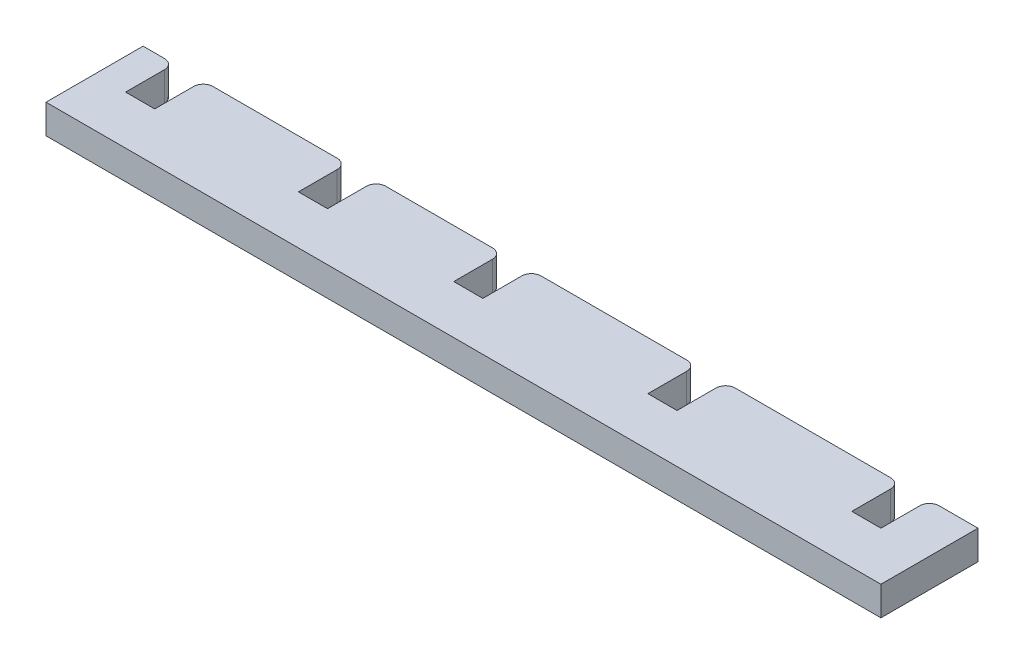
ISO-10303-21;
HEADER;
FILE_DESCRIPTION(('STEP AP214'),'2;1');
FILE_NAME('part.step','',(''),(''),'','','');
FILE_SCHEMA(('AUTOMOTIVE_DESIGN { 1 0 10303 214 1 1 1 1 }'));
ENDSEC;
DATA;
#1=APPLICATION_CONTEXT('core data for automotive mechanical design processes');
#2=APPLICATION_PROTOCOL_DEFINITION('international standard','automotive_design',2000,#1);
#3=PRODUCT_CONTEXT('',#1,'mechanical');
#4=PRODUCT('Part','Part','',(#3));
#5=PRODUCT_RELATED_PRODUCT_CATEGORY('part','',(#4));
#6=PRODUCT_DEFINITION_FORMATION('','',#4);
#7=PRODUCT_DEFINITION_CONTEXT('part definition',#1,'design');
#8=PRODUCT_DEFINITION('design','',#6,#7);
#9=PRODUCT_DEFINITION_SHAPE('','',#8);
#10=(LENGTH_UNIT() NAMED_UNIT(*) SI_UNIT(.MILLI.,.METRE.));
#11=(NAMED_UNIT(*) PLANE_ANGLE_UNIT() SI_UNIT($,.RADIAN.));
#12=(NAMED_UNIT(*) SI_UNIT($,.STERADIAN.) SOLID_ANGLE_UNIT());
#13=UNCERTAINTY_MEASURE_WITH_UNIT(LENGTH_MEASURE(1.E-05),#10,'distance_accuracy_value','');
#14=(GEOMETRIC_REPRESENTATION_CONTEXT(3) GLOBAL_UNCERTAINTY_ASSIGNED_CONTEXT((#13)) GLOBAL_UNIT_ASSIGNED_CONTEXT((#10,
#11,#12)) REPRESENTATION_CONTEXT('',''));
#15=CARTESIAN_POINT('',(0.,0.,0.));
#16=DIRECTION('',(0.,0.,1.));
#17=DIRECTION('',(1.,0.,0.));
#18=AXIS2_PLACEMENT_3D('',#15,#16,#17);
#19=CARTESIAN_POINT('',(0.,0.,0.));
#20=DIRECTION('',(0.,0.,-1.));
#21=DIRECTION('',(-1.,0.,0.));
#22=AXIS2_PLACEMENT_3D('',#19,#20,#21);
#23=PLANE('',#22);
#24=DIRECTION('',(1.,0.,0.));
#25=VECTOR('',#24,1.);
#26=CARTESIAN_POINT('',(0.,0.,0.));
#27=LINE('',#26,#25);
#28=CARTESIAN_POINT('',(82.,0.,0.));
#29=VERTEX_POINT('',#28);
#30=CARTESIAN_POINT('',(86.,0.,0.));
#31=VERTEX_POINT('',#30);
#32=EDGE_CURVE('E389',#29,#31,#27,.T.);
#33=ORIENTED_EDGE('',*,*,#32,.F.);
#34=DIRECTION('',(0.,-1.,0.));
#35=VECTOR('',#34,1.);
#36=CARTESIAN_POINT('',(82.,3.,0.));
#37=LINE('',#36,#35);
#38=CARTESIAN_POINT('',(82.,3.,0.));
#39=VERTEX_POINT('',#38);
#40=EDGE_CURVE('E11',#29,#39,#37,.F.);
#41=ORIENTED_EDGE('',*,*,#40,.T.);
#42=DIRECTION('',(-1.,0.,0.));
#43=VECTOR('',#42,1.);
#44=CARTESIAN_POINT('',(0.,3.,0.));
#45=LINE('',#44,#43);
#46=CARTESIAN_POINT('',(86.,3.,0.));
#47=VERTEX_POINT('',#46);
#48=EDGE_CURVE('E379',#47,#39,#45,.T.);
#49=ORIENTED_EDGE('',*,*,#48,.F.);
#50=DIRECTION('',(0.,1.,0.));
#51=VECTOR('',#50,1.);
#52=CARTESIAN_POINT('',(86.,0.,0.));
#53=LINE('',#52,#51);
#54=EDGE_CURVE('E393',#31,#47,#53,.T.);
#55=ORIENTED_EDGE('',*,*,#54,.F.);
#56=EDGE_LOOP('',(#33,#41,#49,#55));
#57=FACE_BOUND('',#56,.T.);
#58=ADVANCED_FACE('F33',(#57),#23,.T.);
#59=CARTESIAN_POINT('',(61.,0.,0.));
#60=VERTEX_POINT('',#59);
#61=CARTESIAN_POINT('',(77.,0.,0.));
#62=VERTEX_POINT('',#61);
#63=EDGE_CURVE('E395',#60,#62,#27,.T.);
#64=ORIENTED_EDGE('',*,*,#63,.F.);
#65=DIRECTION('',(0.,-1.,0.));
#66=VECTOR('',#65,1.);
#67=CARTESIAN_POINT('',(61.,3.,0.));
#68=LINE('',#67,#66);
#69=CARTESIAN_POINT('',(61.,3.,0.));
#70=VERTEX_POINT('',#69);
#71=EDGE_CURVE('E490',#60,#70,#68,.F.);
#72=ORIENTED_EDGE('',*,*,#71,.T.);
#73=CARTESIAN_POINT('',(77.,3.,0.));
#74=VERTEX_POINT('',#73);
#75=EDGE_CURVE('E400',#74,#70,#45,.T.);
#76=ORIENTED_EDGE('',*,*,#75,.F.);
#77=DIRECTION('',(0.,1.,0.));
#78=VECTOR('',#77,1.);
#79=CARTESIAN_POINT('',(77.,0.,0.));
#80=LINE('',#79,#78);
#81=EDGE_CURVE('E56',#74,#62,#80,.F.);
#82=ORIENTED_EDGE('',*,*,#81,.T.);
#83=EDGE_LOOP('',(#64,#72,#76,#82));
#84=FACE_BOUND('',#83,.T.);
#85=ADVANCED_FACE('F544',(#84),#23,.T.);
#86=CARTESIAN_POINT('',(41.,0.,0.));
#87=VERTEX_POINT('',#86);
#88=CARTESIAN_POINT('',(56.,0.,0.));
#89=VERTEX_POINT('',#88);
#90=EDGE_CURVE('E511',#87,#89,#27,.T.);
#91=ORIENTED_EDGE('',*,*,#90,.F.);
#92=DIRECTION('',(0.,-1.,0.));
#93=VECTOR('',#92,1.);
#94=CARTESIAN_POINT('',(41.,3.,0.));
#95=LINE('',#94,#93);
#96=CARTESIAN_POINT('',(41.,3.,0.));
#97=VERTEX_POINT('',#96);
#98=EDGE_CURVE('E481',#87,#97,#95,.F.);
#99=ORIENTED_EDGE('',*,*,#98,.T.);
#100=CARTESIAN_POINT('',(56.,3.,0.));
#101=VERTEX_POINT('',#100);
#102=EDGE_CURVE('E548',#101,#97,#45,.T.);
#103=ORIENTED_EDGE('',*,*,#102,.F.);
#104=DIRECTION('',(0.,1.,0.));
#105=VECTOR('',#104,1.);
#106=CARTESIAN_POINT('',(56.,0.,0.));
#107=LINE('',#106,#105);
#108=EDGE_CURVE('E479',#101,#89,#107,.F.);
#109=ORIENTED_EDGE('',*,*,#108,.T.);
#110=EDGE_LOOP('',(#91,#99,#103,#109));
#111=FACE_BOUND('',#110,.T.);
#112=ADVANCED_FACE('F589',(#111),#23,.T.);
#113=CARTESIAN_POINT('',(25.,0.,0.));
#114=VERTEX_POINT('',#113);
#115=CARTESIAN_POINT('',(36.,0.,0.));
#116=VERTEX_POINT('',#115);
#117=EDGE_CURVE('E513',#114,#116,#27,.T.);
#118=ORIENTED_EDGE('',*,*,#117,.F.);
#119=DIRECTION('',(0.,-1.,0.));
#120=VECTOR('',#119,1.);
#121=CARTESIAN_POINT('',(25.,3.,0.));
#122=LINE('',#121,#120);
#123=CARTESIAN_POINT('',(25.,3.,0.));
#124=VERTEX_POINT('',#123);
#125=EDGE_CURVE('E471',#114,#124,#122,.F.);
#126=ORIENTED_EDGE('',*,*,#125,.T.);
#127=CARTESIAN_POINT('',(36.,3.,0.));
#128=VERTEX_POINT('',#127);
#129=EDGE_CURVE('E549',#128,#124,#45,.T.);
#130=ORIENTED_EDGE('',*,*,#129,.F.);
#131=DIRECTION('',(0.,1.,0.));
#132=VECTOR('',#131,1.);
#133=CARTESIAN_POINT('',(36.,0.,0.));
#134=LINE('',#133,#132);
#135=EDGE_CURVE('E469',#128,#116,#134,.F.);
#136=ORIENTED_EDGE('',*,*,#135,.T.);
#137=EDGE_LOOP('',(#118,#126,#130,#136));
#138=FACE_BOUND('',#137,.T.);
#139=ADVANCED_FACE('F602',(#138),#23,.T.);
#140=CARTESIAN_POINT('',(7.19999999999998,0.,0.));
#141=VERTEX_POINT('',#140);
#142=CARTESIAN_POINT('',(20.,0.,0.));
#143=VERTEX_POINT('',#142);
#144=EDGE_CURVE('E394',#141,#143,#27,.T.);
#145=ORIENTED_EDGE('',*,*,#144,.F.);
#146=DIRECTION('',(0.,-1.,0.));
#147=VECTOR('',#146,1.);
#148=CARTESIAN_POINT('',(7.19999999999998,3.,0.));
#149=LINE('',#148,#147);
#150=CARTESIAN_POINT('',(7.19999999999998,3.,0.));
#151=VERTEX_POINT('',#150);
#152=EDGE_CURVE('E461',#141,#151,#149,.F.);
#153=ORIENTED_EDGE('',*,*,#152,.T.);
#154=CARTESIAN_POINT('',(20.,3.,0.));
#155=VERTEX_POINT('',#154);
#156=EDGE_CURVE('E552',#155,#151,#45,.T.);
#157=ORIENTED_EDGE('',*,*,#156,.F.);
#158=DIRECTION('',(0.,1.,0.));
#159=VECTOR('',#158,1.);
#160=CARTESIAN_POINT('',(20.,0.,0.));
#161=LINE('',#160,#159);
#162=EDGE_CURVE('E459',#155,#143,#161,.F.);
#163=ORIENTED_EDGE('',*,*,#162,.T.);
#164=EDGE_LOOP('',(#145,#153,#157,#163));
#165=FACE_BOUND('',#164,.T.);
#166=ADVANCED_FACE('F593',(#165),#23,.T.);
#167=CARTESIAN_POINT('',(0.,0.,10.));
#168=DIRECTION('',(1.,0.,0.));
#169=DIRECTION('',(0.,0.,-1.));
#170=AXIS2_PLACEMENT_3D('',#167,#168,#169);
#171=PLANE('',#170);
#172=DIRECTION('',(0.,-1.,0.));
#173=VECTOR('',#172,1.);
#174=CARTESIAN_POINT('',(0.,0.,0.));
#175=LINE('',#174,#173);
#176=CARTESIAN_POINT('',(0.,3.,0.));
#177=VERTEX_POINT('',#176);
#178=CARTESIAN_POINT('',(0.,0.,0.));
#179=VERTEX_POINT('',#178);
#180=EDGE_CURVE('E386',#177,#179,#175,.T.);
#181=ORIENTED_EDGE('',*,*,#180,.T.);
#182=DIRECTION('',(0.,0.,-1.));
#183=VECTOR('',#182,1.);
#184=CARTESIAN_POINT('',(0.,0.,10.));
#185=LINE('',#184,#183);
#186=CARTESIAN_POINT('',(0.,0.,10.));
#187=VERTEX_POINT('',#186);
#188=EDGE_CURVE('E409',#187,#179,#185,.T.);
#189=ORIENTED_EDGE('',*,*,#188,.F.);
#190=DIRECTION('',(0.,-1.,0.));
#191=VECTOR('',#190,1.);
#192=CARTESIAN_POINT('',(0.,0.,10.));
#193=LINE('',#192,#191);
#194=CARTESIAN_POINT('',(0.,3.,10.));
#195=VERTEX_POINT('',#194);
#196=EDGE_CURVE('E375',#195,#187,#193,.T.);
#197=ORIENTED_EDGE('',*,*,#196,.F.);
#198=DIRECTION('',(0.,0.,-1.));
#199=VECTOR('',#198,1.);
#200=CARTESIAN_POINT('',(0.,3.,10.));
#201=LINE('',#200,#199);
#202=EDGE_CURVE('E385',#195,#177,#201,.T.);
#203=ORIENTED_EDGE('',*,*,#202,.T.);
#204=EDGE_LOOP('',(#181,#189,#197,#203));
#205=FACE_BOUND('',#204,.T.);
#206=ADVANCED_FACE('F566',(#205),#171,.F.);
#207=CARTESIAN_POINT('',(0.,0.,10.));
#208=DIRECTION('',(0.,1.,0.));
#209=DIRECTION('',(0.,0.,1.));
#210=AXIS2_PLACEMENT_3D('',#207,#208,#209);
#211=PLANE('',#210);
#212=CARTESIAN_POINT('',(2.19999999999998,0.,0.));
#213=VERTEX_POINT('',#212);
#214=EDGE_CURVE('E391',#179,#213,#27,.T.);
#215=ORIENTED_EDGE('',*,*,#214,.T.);
#216=CARTESIAN_POINT('',(2.19999999999998,0.,1.));
#217=DIRECTION('',(0.,1.,0.));
#218=DIRECTION('',(0.,0.,1.));
#219=AXIS2_PLACEMENT_3D('',#216,#217,#218);
#220=CIRCLE('',#219,1.);
#221=CARTESIAN_POINT('',(3.19999999999998,0.,1.));
#222=VERTEX_POINT('',#221);
#223=EDGE_CURVE('E454',#213,#222,#220,.F.);
#224=ORIENTED_EDGE('',*,*,#223,.T.);
#225=DIRECTION('',(0.,0.,-1.));
#226=VECTOR('',#225,1.);
#227=CARTESIAN_POINT('',(3.19999999999998,0.,5.));
#228=LINE('',#227,#226);
#229=CARTESIAN_POINT('',(3.19999999999998,0.,5.));
#230=VERTEX_POINT('',#229);
#231=EDGE_CURVE('E364',#230,#222,#228,.T.);
#232=ORIENTED_EDGE('',*,*,#231,.F.);
#233=DIRECTION('',(-1.,0.,0.));
#234=VECTOR('',#233,1.);
#235=CARTESIAN_POINT('',(3.19999999999998,0.,5.));
#236=LINE('',#235,#234);
#237=CARTESIAN_POINT('',(6.19999999999998,0.,5.));
#238=VERTEX_POINT('',#237);
#239=EDGE_CURVE('E353',#238,#230,#236,.T.);
#240=ORIENTED_EDGE('',*,*,#239,.F.);
#241=DIRECTION('',(0.,0.,-1.));
#242=VECTOR('',#241,1.);
#243=CARTESIAN_POINT('',(6.19999999999998,0.,5.));
#244=LINE('',#243,#242);
#245=CARTESIAN_POINT('',(6.19999999999998,0.,1.));
#246=VERTEX_POINT('',#245);
#247=EDGE_CURVE('E334',#238,#246,#244,.T.);
#248=ORIENTED_EDGE('',*,*,#247,.T.);
#249=CARTESIAN_POINT('',(7.19999999999998,0.,1.));
#250=DIRECTION('',(0.,1.,0.));
#251=DIRECTION('',(0.,0.,1.));
#252=AXIS2_PLACEMENT_3D('',#249,#250,#251);
#253=CIRCLE('',#252,1.);
#254=EDGE_CURVE('E452',#246,#141,#253,.F.);
#255=ORIENTED_EDGE('',*,*,#254,.T.);
#256=ORIENTED_EDGE('',*,*,#144,.T.);
#257=CARTESIAN_POINT('',(20.,0.,1.));
#258=DIRECTION('',(0.,1.,0.));
#259=DIRECTION('',(0.,0.,1.));
#260=AXIS2_PLACEMENT_3D('',#257,#258,#259);
#261=CIRCLE('',#260,1.);
#262=CARTESIAN_POINT('',(21.,0.,1.));
#263=VERTEX_POINT('',#262);
#264=EDGE_CURVE('E450',#143,#263,#261,.F.);
#265=ORIENTED_EDGE('',*,*,#264,.T.);
#266=DIRECTION('',(0.,0.,-1.));
#267=VECTOR('',#266,1.);
#268=CARTESIAN_POINT('',(21.,0.,5.));
#269=LINE('',#268,#267);
#270=CARTESIAN_POINT('',(21.,0.,5.));
#271=VERTEX_POINT('',#270);
#272=EDGE_CURVE('E342',#271,#263,#269,.T.);
#273=ORIENTED_EDGE('',*,*,#272,.F.);
#274=DIRECTION('',(-1.,0.,0.));
#275=VECTOR('',#274,1.);
#276=CARTESIAN_POINT('',(21.,0.,5.));
#277=LINE('',#276,#275);
#278=CARTESIAN_POINT('',(24.,0.,5.));
#279=VERTEX_POINT('',#278);
#280=EDGE_CURVE('E330',#279,#271,#277,.T.);
#281=ORIENTED_EDGE('',*,*,#280,.F.);
#282=DIRECTION('',(0.,0.,-1.));
#283=VECTOR('',#282,1.);
#284=CARTESIAN_POINT('',(24.,0.,5.));
#285=LINE('',#284,#283);
#286=CARTESIAN_POINT('',(24.,0.,1.));
#287=VERTEX_POINT('',#286);
#288=EDGE_CURVE('E311',#279,#287,#285,.T.);
#289=ORIENTED_EDGE('',*,*,#288,.T.);
#290=CARTESIAN_POINT('',(25.,0.,1.));
#291=DIRECTION('',(0.,1.,0.));
#292=DIRECTION('',(0.,0.,1.));
#293=AXIS2_PLACEMENT_3D('',#290,#291,#292);
#294=CIRCLE('',#293,1.);
#295=EDGE_CURVE('E448',#287,#114,#294,.F.);
#296=ORIENTED_EDGE('',*,*,#295,.T.);
#297=ORIENTED_EDGE('',*,*,#117,.T.);
#298=CARTESIAN_POINT('',(36.,0.,1.));
#299=DIRECTION('',(0.,1.,0.));
#300=DIRECTION('',(0.,0.,1.));
#301=AXIS2_PLACEMENT_3D('',#298,#299,#300);
#302=CIRCLE('',#301,1.);
#303=CARTESIAN_POINT('',(37.,0.,1.));
#304=VERTEX_POINT('',#303);
#305=EDGE_CURVE('E446',#116,#304,#302,.F.);
#306=ORIENTED_EDGE('',*,*,#305,.T.);
#307=DIRECTION('',(0.,0.,-1.));
#308=VECTOR('',#307,1.);
#309=CARTESIAN_POINT('',(37.,0.,5.));
#310=LINE('',#309,#308);
#311=CARTESIAN_POINT('',(37.,0.,5.));
#312=VERTEX_POINT('',#311);
#313=EDGE_CURVE('E319',#312,#304,#310,.T.);
#314=ORIENTED_EDGE('',*,*,#313,.F.);
#315=DIRECTION('',(-1.,0.,0.));
#316=VECTOR('',#315,1.);
#317=CARTESIAN_POINT('',(37.,0.,5.));
#318=LINE('',#317,#316);
#319=CARTESIAN_POINT('',(40.,0.,5.));
#320=VERTEX_POINT('',#319);
#321=EDGE_CURVE('E307',#320,#312,#318,.T.);
#322=ORIENTED_EDGE('',*,*,#321,.F.);
#323=DIRECTION('',(0.,0.,-1.));
#324=VECTOR('',#323,1.);
#325=CARTESIAN_POINT('',(40.,0.,5.));
#326=LINE('',#325,#324);
#327=CARTESIAN_POINT('',(40.,0.,1.));
#328=VERTEX_POINT('',#327);
#329=EDGE_CURVE('E288',#320,#328,#326,.T.);
#330=ORIENTED_EDGE('',*,*,#329,.T.);
#331=CARTESIAN_POINT('',(41.,0.,1.));
#332=DIRECTION('',(0.,1.,0.));
#333=DIRECTION('',(0.,0.,1.));
#334=AXIS2_PLACEMENT_3D('',#331,#332,#333);
#335=CIRCLE('',#334,1.);
#336=EDGE_CURVE('E444',#328,#87,#335,.F.);
#337=ORIENTED_EDGE('',*,*,#336,.T.);
#338=ORIENTED_EDGE('',*,*,#90,.T.);
#339=CARTESIAN_POINT('',(56.,0.,1.));
#340=DIRECTION('',(0.,1.,0.));
#341=DIRECTION('',(0.,0.,1.));
#342=AXIS2_PLACEMENT_3D('',#339,#340,#341);
#343=CIRCLE('',#342,1.);
#344=CARTESIAN_POINT('',(57.,0.,1.));
#345=VERTEX_POINT('',#344);
#346=EDGE_CURVE('E442',#89,#345,#343,.F.);
#347=ORIENTED_EDGE('',*,*,#346,.T.);
#348=DIRECTION('',(0.,0.,-1.));
#349=VECTOR('',#348,1.);
#350=CARTESIAN_POINT('',(57.,0.,5.));
#351=LINE('',#350,#349);
#352=CARTESIAN_POINT('',(57.,0.,5.));
#353=VERTEX_POINT('',#352);
#354=EDGE_CURVE('E296',#353,#345,#351,.T.);
#355=ORIENTED_EDGE('',*,*,#354,.F.);
#356=DIRECTION('',(-1.,0.,0.));
#357=VECTOR('',#356,1.);
#358=CARTESIAN_POINT('',(57.,0.,5.));
#359=LINE('',#358,#357);
#360=CARTESIAN_POINT('',(60.,0.,5.));
#361=VERTEX_POINT('',#360);
#362=EDGE_CURVE('E284',#361,#353,#359,.T.);
#363=ORIENTED_EDGE('',*,*,#362,.F.);
#364=DIRECTION('',(0.,0.,-1.));
#365=VECTOR('',#364,1.);
#366=CARTESIAN_POINT('',(60.,0.,5.));
#367=LINE('',#366,#365);
#368=CARTESIAN_POINT('',(60.,0.,1.));
#369=VERTEX_POINT('',#368);
#370=EDGE_CURVE('E274',#361,#369,#367,.T.);
#371=ORIENTED_EDGE('',*,*,#370,.T.);
#372=CARTESIAN_POINT('',(61.,0.,1.));
#373=DIRECTION('',(0.,1.,0.));
#374=DIRECTION('',(0.,0.,1.));
#375=AXIS2_PLACEMENT_3D('',#372,#373,#374);
#376=CIRCLE('',#375,1.);
#377=EDGE_CURVE('E440',#369,#60,#376,.F.);
#378=ORIENTED_EDGE('',*,*,#377,.T.);
#379=ORIENTED_EDGE('',*,*,#63,.T.);
#380=CARTESIAN_POINT('',(77.,0.,1.));
#381=DIRECTION('',(0.,1.,0.));
#382=DIRECTION('',(0.,0.,1.));
#383=AXIS2_PLACEMENT_3D('',#380,#381,#382);
#384=CIRCLE('',#383,1.);
#385=CARTESIAN_POINT('',(78.,0.,1.));
#386=VERTEX_POINT('',#385);
#387=EDGE_CURVE('E48',#62,#386,#384,.F.);
#388=ORIENTED_EDGE('',*,*,#387,.T.);
#389=DIRECTION('',(0.,0.,-1.));
#390=VECTOR('',#389,1.);
#391=CARTESIAN_POINT('',(78.,0.,5.));
#392=LINE('',#391,#390);
#393=CARTESIAN_POINT('',(78.,0.,5.));
#394=VERTEX_POINT('',#393);
#395=EDGE_CURVE('E259',#394,#386,#392,.T.);
#396=ORIENTED_EDGE('',*,*,#395,.F.);
#397=DIRECTION('',(-1.,0.,0.));
#398=VECTOR('',#397,1.);
#399=CARTESIAN_POINT('',(78.,0.,5.));
#400=LINE('',#399,#398);
#401=CARTESIAN_POINT('',(81.,0.,5.));
#402=VERTEX_POINT('',#401);
#403=EDGE_CURVE('E266',#402,#394,#400,.T.);
#404=ORIENTED_EDGE('',*,*,#403,.F.);
#405=DIRECTION('',(0.,0.,-1.));
#406=VECTOR('',#405,1.);
#407=CARTESIAN_POINT('',(81.,0.,5.));
#408=LINE('',#407,#406);
#409=CARTESIAN_POINT('',(81.,0.,1.));
#410=VERTEX_POINT('',#409);
#411=EDGE_CURVE('E390',#402,#410,#408,.T.);
#412=ORIENTED_EDGE('',*,*,#411,.T.);
#413=CARTESIAN_POINT('',(82.,0.,1.));
#414=DIRECTION('',(0.,1.,0.));
#415=DIRECTION('',(0.,0.,1.));
#416=AXIS2_PLACEMENT_3D('',#413,#414,#415);
#417=CIRCLE('',#416,1.);
#418=EDGE_CURVE('E437',#410,#29,#417,.F.);
#419=ORIENTED_EDGE('',*,*,#418,.T.);
#420=ORIENTED_EDGE('',*,*,#32,.T.);
#421=DIRECTION('',(0.,0.,-1.));
#422=VECTOR('',#421,1.);
#423=CARTESIAN_POINT('',(86.,0.,10.));
#424=LINE('',#423,#422);
#425=CARTESIAN_POINT('',(86.,0.,10.));
#426=VERTEX_POINT('',#425);
#427=EDGE_CURVE('E406',#426,#31,#424,.T.);
#428=ORIENTED_EDGE('',*,*,#427,.F.);
#429=DIRECTION('',(1.,0.,0.));
#430=VECTOR('',#429,1.);
#431=CARTESIAN_POINT('',(0.,0.,10.));
#432=LINE('',#431,#430);
#433=EDGE_CURVE('E378',#187,#426,#432,.T.);
#434=ORIENTED_EDGE('',*,*,#433,.F.);
#435=ORIENTED_EDGE('',*,*,#188,.T.);
#436=EDGE_LOOP('',(#215,#224,#232,#240,#248,#255,#256,#265,#273,#281,#289,#296,#297,#306,#314,
#322,#330,#337,#338,#347,#355,#363,#371,#378,#379,#388,#396,#404,#412,#419,#420,#428,#434,#435));
#437=FACE_BOUND('',#436,.T.);
#438=ADVANCED_FACE('F277',(#437),#211,.F.);
#439=CARTESIAN_POINT('',(86.,0.,10.));
#440=DIRECTION('',(-1.,0.,0.));
#441=DIRECTION('',(0.,0.,1.));
#442=AXIS2_PLACEMENT_3D('',#439,#440,#441);
#443=PLANE('',#442);
#444=ORIENTED_EDGE('',*,*,#54,.T.);
#445=DIRECTION('',(0.,0.,-1.));
#446=VECTOR('',#445,1.);
#447=CARTESIAN_POINT('',(86.,3.,10.));
#448=LINE('',#447,#446);
#449=CARTESIAN_POINT('',(86.,3.,10.));
#450=VERTEX_POINT('',#449);
#451=EDGE_CURVE('E403',#450,#47,#448,.T.);
#452=ORIENTED_EDGE('',*,*,#451,.F.);
#453=DIRECTION('',(0.,1.,0.));
#454=VECTOR('',#453,1.);
#455=CARTESIAN_POINT('',(86.,0.,10.));
#456=LINE('',#455,#454);
#457=EDGE_CURVE('E381',#426,#450,#456,.T.);
#458=ORIENTED_EDGE('',*,*,#457,.F.);
#459=ORIENTED_EDGE('',*,*,#427,.T.);
#460=EDGE_LOOP('',(#444,#452,#458,#459));
#461=FACE_BOUND('',#460,.T.);
#462=ADVANCED_FACE('F575',(#461),#443,.F.);
#463=CARTESIAN_POINT('',(0.,3.,10.));
#464=DIRECTION('',(0.,-1.,0.));
#465=DIRECTION('',(0.,0.,-1.));
#466=AXIS2_PLACEMENT_3D('',#463,#464,#465);
#467=PLANE('',#466);
#468=DIRECTION('',(0.,0.,-1.));
#469=VECTOR('',#468,1.);
#470=CARTESIAN_POINT('',(3.19999999999998,3.,5.));
#471=LINE('',#470,#469);
#472=CARTESIAN_POINT('',(3.19999999999998,3.,5.));
#473=VERTEX_POINT('',#472);
#474=CARTESIAN_POINT('',(3.19999999999998,3.,1.));
#475=VERTEX_POINT('',#474);
#476=EDGE_CURVE('E370',#473,#475,#471,.T.);
#477=ORIENTED_EDGE('',*,*,#476,.T.);
#478=CARTESIAN_POINT('',(2.19999999999998,3.,1.));
#479=DIRECTION('',(0.,-1.,0.));
#480=DIRECTION('',(0.,0.,-1.));
#481=AXIS2_PLACEMENT_3D('',#478,#479,#480);
#482=CIRCLE('',#481,1.);
#483=CARTESIAN_POINT('',(2.19999999999998,3.,0.));
#484=VERTEX_POINT('',#483);
#485=EDGE_CURVE('E433',#475,#484,#482,.F.);
#486=ORIENTED_EDGE('',*,*,#485,.T.);
#487=EDGE_CURVE('E397',#484,#177,#45,.T.);
#488=ORIENTED_EDGE('',*,*,#487,.T.);
#489=ORIENTED_EDGE('',*,*,#202,.F.);
#490=DIRECTION('',(-1.,0.,0.));
#491=VECTOR('',#490,1.);
#492=CARTESIAN_POINT('',(0.,3.,10.));
#493=LINE('',#492,#491);
#494=EDGE_CURVE('E383',#450,#195,#493,.T.);
#495=ORIENTED_EDGE('',*,*,#494,.F.);
#496=ORIENTED_EDGE('',*,*,#451,.T.);
#497=ORIENTED_EDGE('',*,*,#48,.T.);
#498=CARTESIAN_POINT('',(82.,3.,1.));
#499=DIRECTION('',(0.,-1.,0.));
#500=DIRECTION('',(0.,0.,-1.));
#501=AXIS2_PLACEMENT_3D('',#498,#499,#500);
#502=CIRCLE('',#501,1.);
#503=CARTESIAN_POINT('',(81.,3.,1.));
#504=VERTEX_POINT('',#503);
#505=EDGE_CURVE('E415',#39,#504,#502,.F.);
#506=ORIENTED_EDGE('',*,*,#505,.T.);
#507=DIRECTION('',(0.,0.,-1.));
#508=VECTOR('',#507,1.);
#509=CARTESIAN_POINT('',(81.,3.,5.));
#510=LINE('',#509,#508);
#511=CARTESIAN_POINT('',(81.,3.,5.));
#512=VERTEX_POINT('',#511);
#513=EDGE_CURVE('E279',#512,#504,#510,.T.);
#514=ORIENTED_EDGE('',*,*,#513,.F.);
#515=DIRECTION('',(1.,0.,0.));
#516=VECTOR('',#515,1.);
#517=CARTESIAN_POINT('',(81.,3.,5.));
#518=LINE('',#517,#516);
#519=CARTESIAN_POINT('',(78.,3.,5.));
#520=VERTEX_POINT('',#519);
#521=EDGE_CURVE('E265',#520,#512,#518,.T.);
#522=ORIENTED_EDGE('',*,*,#521,.F.);
#523=DIRECTION('',(0.,0.,-1.));
#524=VECTOR('',#523,1.);
#525=CARTESIAN_POINT('',(78.,3.,5.));
#526=LINE('',#525,#524);
#527=CARTESIAN_POINT('',(78.,3.,1.));
#528=VERTEX_POINT('',#527);
#529=EDGE_CURVE('E262',#520,#528,#526,.T.);
#530=ORIENTED_EDGE('',*,*,#529,.T.);
#531=CARTESIAN_POINT('',(77.,3.,1.));
#532=DIRECTION('',(0.,-1.,0.));
#533=DIRECTION('',(0.,0.,-1.));
#534=AXIS2_PLACEMENT_3D('',#531,#532,#533);
#535=CIRCLE('',#534,1.);
#536=EDGE_CURVE('E417',#528,#74,#535,.F.);
#537=ORIENTED_EDGE('',*,*,#536,.T.);
#538=ORIENTED_EDGE('',*,*,#75,.T.);
#539=CARTESIAN_POINT('',(61.,3.,1.));
#540=DIRECTION('',(0.,-1.,0.));
#541=DIRECTION('',(0.,0.,-1.));
#542=AXIS2_PLACEMENT_3D('',#539,#540,#541);
#543=CIRCLE('',#542,1.);
#544=CARTESIAN_POINT('',(60.,3.,1.));
#545=VERTEX_POINT('',#544);
#546=EDGE_CURVE('E419',#70,#545,#543,.F.);
#547=ORIENTED_EDGE('',*,*,#546,.T.);
#548=DIRECTION('',(0.,0.,-1.));
#549=VECTOR('',#548,1.);
#550=CARTESIAN_POINT('',(60.,3.,5.));
#551=LINE('',#550,#549);
#552=CARTESIAN_POINT('',(60.,3.,5.));
#553=VERTEX_POINT('',#552);
#554=EDGE_CURVE('E299',#553,#545,#551,.T.);
#555=ORIENTED_EDGE('',*,*,#554,.F.);
#556=DIRECTION('',(1.,0.,0.));
#557=VECTOR('',#556,1.);
#558=CARTESIAN_POINT('',(60.,3.,5.));
#559=LINE('',#558,#557);
#560=CARTESIAN_POINT('',(57.,3.,5.));
#561=VERTEX_POINT('',#560);
#562=EDGE_CURVE('E291',#561,#553,#559,.T.);
#563=ORIENTED_EDGE('',*,*,#562,.F.);
#564=DIRECTION('',(0.,0.,-1.));
#565=VECTOR('',#564,1.);
#566=CARTESIAN_POINT('',(57.,3.,5.));
#567=LINE('',#566,#565);
#568=CARTESIAN_POINT('',(57.,3.,1.));
#569=VERTEX_POINT('',#568);
#570=EDGE_CURVE('E302',#561,#569,#567,.T.);
#571=ORIENTED_EDGE('',*,*,#570,.T.);
#572=CARTESIAN_POINT('',(56.,3.,1.));
#573=DIRECTION('',(0.,-1.,0.));
#574=DIRECTION('',(0.,0.,-1.));
#575=AXIS2_PLACEMENT_3D('',#572,#573,#574);
#576=CIRCLE('',#575,1.);
#577=EDGE_CURVE('E421',#569,#101,#576,.F.);
#578=ORIENTED_EDGE('',*,*,#577,.T.);
#579=ORIENTED_EDGE('',*,*,#102,.T.);
#580=CARTESIAN_POINT('',(41.,3.,1.));
#581=DIRECTION('',(0.,-1.,0.));
#582=DIRECTION('',(0.,0.,-1.));
#583=AXIS2_PLACEMENT_3D('',#580,#581,#582);
#584=CIRCLE('',#583,1.);
#585=CARTESIAN_POINT('',(40.,3.,1.));
#586=VERTEX_POINT('',#585);
#587=EDGE_CURVE('E423',#97,#586,#584,.F.);
#588=ORIENTED_EDGE('',*,*,#587,.T.);
#589=DIRECTION('',(0.,0.,-1.));
#590=VECTOR('',#589,1.);
#591=CARTESIAN_POINT('',(40.,3.,5.));
#592=LINE('',#591,#590);
#593=CARTESIAN_POINT('',(40.,3.,5.));
#594=VERTEX_POINT('',#593);
#595=EDGE_CURVE('E322',#594,#586,#592,.T.);
#596=ORIENTED_EDGE('',*,*,#595,.F.);
#597=DIRECTION('',(1.,0.,0.));
#598=VECTOR('',#597,1.);
#599=CARTESIAN_POINT('',(40.,3.,5.));
#600=LINE('',#599,#598);
#601=CARTESIAN_POINT('',(37.,3.,5.));
#602=VERTEX_POINT('',#601);
#603=EDGE_CURVE('E314',#602,#594,#600,.T.);
#604=ORIENTED_EDGE('',*,*,#603,.F.);
#605=DIRECTION('',(0.,0.,-1.));
#606=VECTOR('',#605,1.);
#607=CARTESIAN_POINT('',(37.,3.,5.));
#608=LINE('',#607,#606);
#609=CARTESIAN_POINT('',(37.,3.,1.));
#610=VERTEX_POINT('',#609);
#611=EDGE_CURVE('E325',#602,#610,#608,.T.);
#612=ORIENTED_EDGE('',*,*,#611,.T.);
#613=CARTESIAN_POINT('',(36.,3.,1.));
#614=DIRECTION('',(0.,-1.,0.));
#615=DIRECTION('',(0.,0.,-1.));
#616=AXIS2_PLACEMENT_3D('',#613,#614,#615);
#617=CIRCLE('',#616,1.);
#618=EDGE_CURVE('E425',#610,#128,#617,.F.);
#619=ORIENTED_EDGE('',*,*,#618,.T.);
#620=ORIENTED_EDGE('',*,*,#129,.T.);
#621=CARTESIAN_POINT('',(25.,3.,1.));
#622=DIRECTION('',(0.,-1.,0.));
#623=DIRECTION('',(0.,0.,-1.));
#624=AXIS2_PLACEMENT_3D('',#621,#622,#623);
#625=CIRCLE('',#624,1.);
#626=CARTESIAN_POINT('',(24.,3.,1.));
#627=VERTEX_POINT('',#626);
#628=EDGE_CURVE('E427',#124,#627,#625,.F.);
#629=ORIENTED_EDGE('',*,*,#628,.T.);
#630=DIRECTION('',(0.,0.,-1.));
#631=VECTOR('',#630,1.);
#632=CARTESIAN_POINT('',(24.,3.,5.));
#633=LINE('',#632,#631);
#634=CARTESIAN_POINT('',(24.,3.,5.));
#635=VERTEX_POINT('',#634);
#636=EDGE_CURVE('E345',#635,#627,#633,.T.);
#637=ORIENTED_EDGE('',*,*,#636,.F.);
#638=DIRECTION('',(1.,0.,0.));
#639=VECTOR('',#638,1.);
#640=CARTESIAN_POINT('',(24.,3.,5.));
#641=LINE('',#640,#639);
#642=CARTESIAN_POINT('',(21.,3.,5.));
#643=VERTEX_POINT('',#642);
#644=EDGE_CURVE('E337',#643,#635,#641,.T.);
#645=ORIENTED_EDGE('',*,*,#644,.F.);
#646=DIRECTION('',(0.,0.,-1.));
#647=VECTOR('',#646,1.);
#648=CARTESIAN_POINT('',(21.,3.,5.));
#649=LINE('',#648,#647);
#650=CARTESIAN_POINT('',(21.,3.,1.));
#651=VERTEX_POINT('',#650);
#652=EDGE_CURVE('E348',#643,#651,#649,.T.);
#653=ORIENTED_EDGE('',*,*,#652,.T.);
#654=CARTESIAN_POINT('',(20.,3.,1.));
#655=DIRECTION('',(0.,-1.,0.));
#656=DIRECTION('',(0.,0.,-1.));
#657=AXIS2_PLACEMENT_3D('',#654,#655,#656);
#658=CIRCLE('',#657,1.);
#659=EDGE_CURVE('E429',#651,#155,#658,.F.);
#660=ORIENTED_EDGE('',*,*,#659,.T.);
#661=ORIENTED_EDGE('',*,*,#156,.T.);
#662=CARTESIAN_POINT('',(7.19999999999998,3.,1.));
#663=DIRECTION('',(0.,-1.,0.));
#664=DIRECTION('',(0.,0.,-1.));
#665=AXIS2_PLACEMENT_3D('',#662,#663,#664);
#666=CIRCLE('',#665,1.);
#667=CARTESIAN_POINT('',(6.19999999999998,3.,1.));
#668=VERTEX_POINT('',#667);
#669=EDGE_CURVE('E431',#151,#668,#666,.F.);
#670=ORIENTED_EDGE('',*,*,#669,.T.);
#671=DIRECTION('',(0.,0.,-1.));
#672=VECTOR('',#671,1.);
#673=CARTESIAN_POINT('',(6.19999999999998,3.,5.));
#674=LINE('',#673,#672);
#675=CARTESIAN_POINT('',(6.19999999999998,3.,5.));
#676=VERTEX_POINT('',#675);
#677=EDGE_CURVE('E367',#676,#668,#674,.T.);
#678=ORIENTED_EDGE('',*,*,#677,.F.);
#679=DIRECTION('',(1.,0.,0.));
#680=VECTOR('',#679,1.);
#681=CARTESIAN_POINT('',(6.19999999999998,3.,5.));
#682=LINE('',#681,#680);
#683=EDGE_CURVE('E359',#473,#676,#682,.T.);
#684=ORIENTED_EDGE('',*,*,#683,.F.);
#685=EDGE_LOOP('',(#477,#486,#488,#489,#495,#496,#497,#506,#514,#522,#530,#537,#538,#547,#555,
#563,#571,#578,#579,#588,#596,#604,#612,#619,#620,#629,#637,#645,#653,#660,#661,#670,#678,#684));
#686=FACE_BOUND('',#685,.T.);
#687=ADVANCED_FACE('F505',(#686),#467,.F.);
#688=CARTESIAN_POINT('',(0.,0.,10.));
#689=DIRECTION('',(0.,0.,-1.));
#690=DIRECTION('',(-1.,0.,0.));
#691=AXIS2_PLACEMENT_3D('',#688,#689,#690);
#692=PLANE('',#691);
#693=ORIENTED_EDGE('',*,*,#196,.T.);
#694=ORIENTED_EDGE('',*,*,#433,.T.);
#695=ORIENTED_EDGE('',*,*,#457,.T.);
#696=ORIENTED_EDGE('',*,*,#494,.T.);
#697=EDGE_LOOP('',(#693,#694,#695,#696));
#698=FACE_BOUND('',#697,.T.);
#699=ADVANCED_FACE('F572',(#698),#692,.F.);
#700=ORIENTED_EDGE('',*,*,#487,.F.);
#701=DIRECTION('',(0.,1.,0.));
#702=VECTOR('',#701,1.);
#703=CARTESIAN_POINT('',(2.19999999999998,0.,0.));
#704=LINE('',#703,#702);
#705=EDGE_CURVE('E435',#484,#213,#704,.F.);
#706=ORIENTED_EDGE('',*,*,#705,.T.);
#707=ORIENTED_EDGE('',*,*,#214,.F.);
#708=ORIENTED_EDGE('',*,*,#180,.F.);
#709=EDGE_LOOP('',(#700,#706,#707,#708));
#710=FACE_BOUND('',#709,.T.);
#711=ADVANCED_FACE('F568',(#710),#23,.T.);
#712=CARTESIAN_POINT('',(6.19999999999998,3.,5.));
#713=DIRECTION('',(1.,0.,0.));
#714=DIRECTION('',(0.,0.,-1.));
#715=AXIS2_PLACEMENT_3D('',#712,#713,#714);
#716=PLANE('',#715);
#717=ORIENTED_EDGE('',*,*,#677,.T.);
#718=DIRECTION('',(0.,-1.,0.));
#719=VECTOR('',#718,1.);
#720=CARTESIAN_POINT('',(6.19999999999998,0.,1.));
#721=LINE('',#720,#719);
#722=EDGE_CURVE('E456',#668,#246,#721,.T.);
#723=ORIENTED_EDGE('',*,*,#722,.T.);
#724=ORIENTED_EDGE('',*,*,#247,.F.);
#725=DIRECTION('',(0.,-1.,0.));
#726=VECTOR('',#725,1.);
#727=CARTESIAN_POINT('',(6.19999999999998,3.,5.));
#728=LINE('',#727,#726);
#729=EDGE_CURVE('E361',#676,#238,#728,.T.);
#730=ORIENTED_EDGE('',*,*,#729,.F.);
#731=EDGE_LOOP('',(#717,#723,#724,#730));
#732=FACE_BOUND('',#731,.T.);
#733=ADVANCED_FACE('F592',(#732),#716,.F.);
#734=CARTESIAN_POINT('',(3.19999999999998,3.,5.));
#735=DIRECTION('',(-1.,0.,0.));
#736=DIRECTION('',(0.,-1.,0.));
#737=AXIS2_PLACEMENT_3D('',#734,#735,#736);
#738=PLANE('',#737);
#739=ORIENTED_EDGE('',*,*,#231,.T.);
#740=DIRECTION('',(0.,1.,0.));
#741=VECTOR('',#740,1.);
#742=CARTESIAN_POINT('',(3.19999999999998,3.,1.));
#743=LINE('',#742,#741);
#744=EDGE_CURVE('E412',#222,#475,#743,.T.);
#745=ORIENTED_EDGE('',*,*,#744,.T.);
#746=ORIENTED_EDGE('',*,*,#476,.F.);
#747=DIRECTION('',(0.,1.,0.));
#748=VECTOR('',#747,1.);
#749=CARTESIAN_POINT('',(3.19999999999998,3.,5.));
#750=LINE('',#749,#748);
#751=EDGE_CURVE('E356',#230,#473,#750,.T.);
#752=ORIENTED_EDGE('',*,*,#751,.F.);
#753=EDGE_LOOP('',(#739,#745,#746,#752));
#754=FACE_BOUND('',#753,.T.);
#755=ADVANCED_FACE('F598',(#754),#738,.F.);
#756=CARTESIAN_POINT('',(0.,0.,5.));
#757=DIRECTION('',(0.,0.,-1.));
#758=DIRECTION('',(-1.,0.,0.));
#759=AXIS2_PLACEMENT_3D('',#756,#757,#758);
#760=PLANE('',#759);
#761=ORIENTED_EDGE('',*,*,#239,.T.);
#762=ORIENTED_EDGE('',*,*,#751,.T.);
#763=ORIENTED_EDGE('',*,*,#683,.T.);
#764=ORIENTED_EDGE('',*,*,#729,.T.);
#765=EDGE_LOOP('',(#761,#762,#763,#764));
#766=FACE_BOUND('',#765,.T.);
#767=ADVANCED_FACE('F620',(#766),#760,.T.);
#768=CARTESIAN_POINT('',(24.,3.,5.));
#769=DIRECTION('',(1.,0.,0.));
#770=DIRECTION('',(0.,0.,-1.));
#771=AXIS2_PLACEMENT_3D('',#768,#769,#770);
#772=PLANE('',#771);
#773=ORIENTED_EDGE('',*,*,#636,.T.);
#774=DIRECTION('',(0.,-1.,0.));
#775=VECTOR('',#774,1.);
#776=CARTESIAN_POINT('',(24.,0.,1.));
#777=LINE('',#776,#775);
#778=EDGE_CURVE('E466',#627,#287,#777,.T.);
#779=ORIENTED_EDGE('',*,*,#778,.T.);
#780=ORIENTED_EDGE('',*,*,#288,.F.);
#781=DIRECTION('',(0.,-1.,0.));
#782=VECTOR('',#781,1.);
#783=CARTESIAN_POINT('',(24.,3.,5.));
#784=LINE('',#783,#782);
#785=EDGE_CURVE('E339',#635,#279,#784,.T.);
#786=ORIENTED_EDGE('',*,*,#785,.F.);
#787=EDGE_LOOP('',(#773,#779,#780,#786));
#788=FACE_BOUND('',#787,.T.);
#789=ADVANCED_FACE('F786',(#788),#772,.F.);
#790=CARTESIAN_POINT('',(21.,3.,5.));
#791=DIRECTION('',(-1.,0.,0.));
#792=DIRECTION('',(0.,-1.,0.));
#793=AXIS2_PLACEMENT_3D('',#790,#791,#792);
#794=PLANE('',#793);
#795=ORIENTED_EDGE('',*,*,#272,.T.);
#796=DIRECTION('',(0.,1.,0.));
#797=VECTOR('',#796,1.);
#798=CARTESIAN_POINT('',(21.,3.,1.));
#799=LINE('',#798,#797);
#800=EDGE_CURVE('E463',#263,#651,#799,.T.);
#801=ORIENTED_EDGE('',*,*,#800,.T.);
#802=ORIENTED_EDGE('',*,*,#652,.F.);
#803=DIRECTION('',(0.,1.,0.));
#804=VECTOR('',#803,1.);
#805=CARTESIAN_POINT('',(21.,3.,5.));
#806=LINE('',#805,#804);
#807=EDGE_CURVE('E333',#271,#643,#806,.T.);
#808=ORIENTED_EDGE('',*,*,#807,.F.);
#809=EDGE_LOOP('',(#795,#801,#802,#808));
#810=FACE_BOUND('',#809,.T.);
#811=ADVANCED_FACE('F781',(#810),#794,.F.);
#812=CARTESIAN_POINT('',(0.,0.,5.));
#813=DIRECTION('',(0.,0.,-1.));
#814=DIRECTION('',(-1.,0.,0.));
#815=AXIS2_PLACEMENT_3D('',#812,#813,#814);
#816=PLANE('',#815);
#817=ORIENTED_EDGE('',*,*,#280,.T.);
#818=ORIENTED_EDGE('',*,*,#807,.T.);
#819=ORIENTED_EDGE('',*,*,#644,.T.);
#820=ORIENTED_EDGE('',*,*,#785,.T.);
#821=EDGE_LOOP('',(#817,#818,#819,#820));
#822=FACE_BOUND('',#821,.T.);
#823=ADVANCED_FACE('F773',(#822),#816,.T.);
#824=CARTESIAN_POINT('',(40.,3.,5.));
#825=DIRECTION('',(1.,0.,0.));
#826=DIRECTION('',(0.,0.,-1.));
#827=AXIS2_PLACEMENT_3D('',#824,#825,#826);
#828=PLANE('',#827);
#829=ORIENTED_EDGE('',*,*,#595,.T.);
#830=DIRECTION('',(0.,-1.,0.));
#831=VECTOR('',#830,1.);
#832=CARTESIAN_POINT('',(40.,0.,1.));
#833=LINE('',#832,#831);
#834=EDGE_CURVE('E476',#586,#328,#833,.T.);
#835=ORIENTED_EDGE('',*,*,#834,.T.);
#836=ORIENTED_EDGE('',*,*,#329,.F.);
#837=DIRECTION('',(0.,-1.,0.));
#838=VECTOR('',#837,1.);
#839=CARTESIAN_POINT('',(40.,3.,5.));
#840=LINE('',#839,#838);
#841=EDGE_CURVE('E316',#594,#320,#840,.T.);
#842=ORIENTED_EDGE('',*,*,#841,.F.);
#843=EDGE_LOOP('',(#829,#835,#836,#842));
#844=FACE_BOUND('',#843,.T.);
#845=ADVANCED_FACE('F762',(#844),#828,.F.);
#846=CARTESIAN_POINT('',(37.,3.,5.));
#847=DIRECTION('',(-1.,0.,0.));
#848=DIRECTION('',(0.,0.,1.));
#849=AXIS2_PLACEMENT_3D('',#846,#847,#848);
#850=PLANE('',#849);
#851=ORIENTED_EDGE('',*,*,#313,.T.);
#852=DIRECTION('',(0.,1.,0.));
#853=VECTOR('',#852,1.);
#854=CARTESIAN_POINT('',(37.,3.,1.));
#855=LINE('',#854,#853);
#856=EDGE_CURVE('E473',#304,#610,#855,.T.);
#857=ORIENTED_EDGE('',*,*,#856,.T.);
#858=ORIENTED_EDGE('',*,*,#611,.F.);
#859=DIRECTION('',(0.,1.,0.));
#860=VECTOR('',#859,1.);
#861=CARTESIAN_POINT('',(37.,3.,5.));
#862=LINE('',#861,#860);
#863=EDGE_CURVE('E310',#312,#602,#862,.T.);
#864=ORIENTED_EDGE('',*,*,#863,.F.);
#865=EDGE_LOOP('',(#851,#857,#858,#864));
#866=FACE_BOUND('',#865,.T.);
#867=ADVANCED_FACE('F757',(#866),#850,.F.);
#868=CARTESIAN_POINT('',(0.,0.,5.));
#869=DIRECTION('',(0.,0.,-1.));
#870=DIRECTION('',(-1.,0.,0.));
#871=AXIS2_PLACEMENT_3D('',#868,#869,#870);
#872=PLANE('',#871);
#873=ORIENTED_EDGE('',*,*,#321,.T.);
#874=ORIENTED_EDGE('',*,*,#863,.T.);
#875=ORIENTED_EDGE('',*,*,#603,.T.);
#876=ORIENTED_EDGE('',*,*,#841,.T.);
#877=EDGE_LOOP('',(#873,#874,#875,#876));
#878=FACE_BOUND('',#877,.T.);
#879=ADVANCED_FACE('F750',(#878),#872,.T.);
#880=CARTESIAN_POINT('',(60.,3.,5.));
#881=DIRECTION('',(1.,0.,0.));
#882=DIRECTION('',(0.,0.,-1.));
#883=AXIS2_PLACEMENT_3D('',#880,#881,#882);
#884=PLANE('',#883);
#885=ORIENTED_EDGE('',*,*,#554,.T.);
#886=DIRECTION('',(0.,-1.,0.));
#887=VECTOR('',#886,1.);
#888=CARTESIAN_POINT('',(60.,0.,1.));
#889=LINE('',#888,#887);
#890=EDGE_CURVE('E486',#545,#369,#889,.T.);
#891=ORIENTED_EDGE('',*,*,#890,.T.);
#892=ORIENTED_EDGE('',*,*,#370,.F.);
#893=DIRECTION('',(0.,-1.,0.));
#894=VECTOR('',#893,1.);
#895=CARTESIAN_POINT('',(60.,3.,5.));
#896=LINE('',#895,#894);
#897=EDGE_CURVE('E293',#553,#361,#896,.T.);
#898=ORIENTED_EDGE('',*,*,#897,.F.);
#899=EDGE_LOOP('',(#885,#891,#892,#898));
#900=FACE_BOUND('',#899,.T.);
#901=ADVANCED_FACE('F540',(#900),#884,.F.);
#902=CARTESIAN_POINT('',(57.,3.,5.));
#903=DIRECTION('',(-1.,0.,0.));
#904=DIRECTION('',(0.,0.,1.));
#905=AXIS2_PLACEMENT_3D('',#902,#903,#904);
#906=PLANE('',#905);
#907=ORIENTED_EDGE('',*,*,#354,.T.);
#908=DIRECTION('',(0.,1.,0.));
#909=VECTOR('',#908,1.);
#910=CARTESIAN_POINT('',(57.,3.,1.));
#911=LINE('',#910,#909);
#912=EDGE_CURVE('E483',#345,#569,#911,.T.);
#913=ORIENTED_EDGE('',*,*,#912,.T.);
#914=ORIENTED_EDGE('',*,*,#570,.F.);
#915=DIRECTION('',(0.,1.,0.));
#916=VECTOR('',#915,1.);
#917=CARTESIAN_POINT('',(57.,3.,5.));
#918=LINE('',#917,#916);
#919=EDGE_CURVE('E287',#353,#561,#918,.T.);
#920=ORIENTED_EDGE('',*,*,#919,.F.);
#921=EDGE_LOOP('',(#907,#913,#914,#920));
#922=FACE_BOUND('',#921,.T.);
#923=ADVANCED_FACE('F530',(#922),#906,.F.);
#924=CARTESIAN_POINT('',(0.,0.,5.));
#925=DIRECTION('',(0.,0.,-1.));
#926=DIRECTION('',(-1.,0.,0.));
#927=AXIS2_PLACEMENT_3D('',#924,#925,#926);
#928=PLANE('',#927);
#929=ORIENTED_EDGE('',*,*,#362,.T.);
#930=ORIENTED_EDGE('',*,*,#919,.T.);
#931=ORIENTED_EDGE('',*,*,#562,.T.);
#932=ORIENTED_EDGE('',*,*,#897,.T.);
#933=EDGE_LOOP('',(#929,#930,#931,#932));
#934=FACE_BOUND('',#933,.T.);
#935=ADVANCED_FACE('F537',(#934),#928,.T.);
#936=CARTESIAN_POINT('',(81.,3.,5.));
#937=DIRECTION('',(1.,0.,0.));
#938=DIRECTION('',(0.,0.,-1.));
#939=AXIS2_PLACEMENT_3D('',#936,#937,#938);
#940=PLANE('',#939);
#941=ORIENTED_EDGE('',*,*,#513,.T.);
#942=DIRECTION('',(0.,-1.,0.));
#943=VECTOR('',#942,1.);
#944=CARTESIAN_POINT('',(81.,0.,1.));
#945=LINE('',#944,#943);
#946=EDGE_CURVE('E41',#504,#410,#945,.T.);
#947=ORIENTED_EDGE('',*,*,#946,.T.);
#948=ORIENTED_EDGE('',*,*,#411,.F.);
#949=DIRECTION('',(0.,-1.,0.));
#950=VECTOR('',#949,1.);
#951=CARTESIAN_POINT('',(81.,3.,5.));
#952=LINE('',#951,#950);
#953=EDGE_CURVE('E272',#512,#402,#952,.T.);
#954=ORIENTED_EDGE('',*,*,#953,.F.);
#955=EDGE_LOOP('',(#941,#947,#948,#954));
#956=FACE_BOUND('',#955,.T.);
#957=ADVANCED_FACE('F497',(#956),#940,.F.);
#958=CARTESIAN_POINT('',(78.,3.,5.));
#959=DIRECTION('',(-1.,0.,0.));
#960=DIRECTION('',(0.,0.,1.));
#961=AXIS2_PLACEMENT_3D('',#958,#959,#960);
#962=PLANE('',#961);
#963=ORIENTED_EDGE('',*,*,#395,.T.);
#964=DIRECTION('',(0.,1.,0.));
#965=VECTOR('',#964,1.);
#966=CARTESIAN_POINT('',(78.,3.,1.));
#967=LINE('',#966,#965);
#968=EDGE_CURVE('E492',#386,#528,#967,.T.);
#969=ORIENTED_EDGE('',*,*,#968,.T.);
#970=ORIENTED_EDGE('',*,*,#529,.F.);
#971=DIRECTION('',(0.,1.,0.));
#972=VECTOR('',#971,1.);
#973=CARTESIAN_POINT('',(78.,3.,5.));
#974=LINE('',#973,#972);
#975=EDGE_CURVE('E255',#394,#520,#974,.T.);
#976=ORIENTED_EDGE('',*,*,#975,.F.);
#977=EDGE_LOOP('',(#963,#969,#970,#976));
#978=FACE_BOUND('',#977,.T.);
#979=ADVANCED_FACE('F257',(#978),#962,.F.);
#980=CARTESIAN_POINT('',(0.,0.,5.));
#981=DIRECTION('',(0.,0.,-1.));
#982=DIRECTION('',(-1.,0.,0.));
#983=AXIS2_PLACEMENT_3D('',#980,#981,#982);
#984=PLANE('',#983);
#985=ORIENTED_EDGE('',*,*,#403,.T.);
#986=ORIENTED_EDGE('',*,*,#975,.T.);
#987=ORIENTED_EDGE('',*,*,#521,.T.);
#988=ORIENTED_EDGE('',*,*,#953,.T.);
#989=EDGE_LOOP('',(#985,#986,#987,#988));
#990=FACE_BOUND('',#989,.T.);
#991=ADVANCED_FACE('F270',(#990),#984,.T.);
#992=CARTESIAN_POINT('',(2.19999999999998,3.,1.));
#993=DIRECTION('',(0.,-1.,0.));
#994=DIRECTION('',(1.,0.,0.));
#995=AXIS2_PLACEMENT_3D('',#992,#993,#994);
#996=CYLINDRICAL_SURFACE('',#995,1.);
#997=ORIENTED_EDGE('',*,*,#223,.F.);
#998=ORIENTED_EDGE('',*,*,#705,.F.);
#999=ORIENTED_EDGE('',*,*,#485,.F.);
#1000=ORIENTED_EDGE('',*,*,#744,.F.);
#1001=EDGE_LOOP('',(#997,#998,#999,#1000));
#1002=FACE_BOUND('',#1001,.T.);
#1003=ADVANCED_FACE('F625',(#1002),#996,.T.);
#1004=CARTESIAN_POINT('',(7.19999999999998,3.,1.));
#1005=DIRECTION('',(0.,1.,0.));
#1006=DIRECTION('',(0.,0.,1.));
#1007=AXIS2_PLACEMENT_3D('',#1004,#1005,#1006);
#1008=CYLINDRICAL_SURFACE('',#1007,1.);
#1009=ORIENTED_EDGE('',*,*,#669,.F.);
#1010=ORIENTED_EDGE('',*,*,#152,.F.);
#1011=ORIENTED_EDGE('',*,*,#254,.F.);
#1012=ORIENTED_EDGE('',*,*,#722,.F.);
#1013=EDGE_LOOP('',(#1009,#1010,#1011,#1012));
#1014=FACE_BOUND('',#1013,.T.);
#1015=ADVANCED_FACE('F613',(#1014),#1008,.T.);
#1016=CARTESIAN_POINT('',(20.,3.,1.));
#1017=DIRECTION('',(0.,-1.,0.));
#1018=DIRECTION('',(1.,0.,0.));
#1019=AXIS2_PLACEMENT_3D('',#1016,#1017,#1018);
#1020=CYLINDRICAL_SURFACE('',#1019,1.);
#1021=ORIENTED_EDGE('',*,*,#264,.F.);
#1022=ORIENTED_EDGE('',*,*,#162,.F.);
#1023=ORIENTED_EDGE('',*,*,#659,.F.);
#1024=ORIENTED_EDGE('',*,*,#800,.F.);
#1025=EDGE_LOOP('',(#1021,#1022,#1023,#1024));
#1026=FACE_BOUND('',#1025,.T.);
#1027=ADVANCED_FACE('F632',(#1026),#1020,.T.);
#1028=CARTESIAN_POINT('',(25.,3.,1.));
#1029=DIRECTION('',(0.,1.,0.));
#1030=DIRECTION('',(0.,0.,1.));
#1031=AXIS2_PLACEMENT_3D('',#1028,#1029,#1030);
#1032=CYLINDRICAL_SURFACE('',#1031,1.);
#1033=ORIENTED_EDGE('',*,*,#628,.F.);
#1034=ORIENTED_EDGE('',*,*,#125,.F.);
#1035=ORIENTED_EDGE('',*,*,#295,.F.);
#1036=ORIENTED_EDGE('',*,*,#778,.F.);
#1037=EDGE_LOOP('',(#1033,#1034,#1035,#1036));
#1038=FACE_BOUND('',#1037,.T.);
#1039=ADVANCED_FACE('F638',(#1038),#1032,.T.);
#1040=CARTESIAN_POINT('',(36.,3.,1.));
#1041=DIRECTION('',(0.,-1.,0.));
#1042=DIRECTION('',(0.,0.,-1.));
#1043=AXIS2_PLACEMENT_3D('',#1040,#1041,#1042);
#1044=CYLINDRICAL_SURFACE('',#1043,1.);
#1045=ORIENTED_EDGE('',*,*,#305,.F.);
#1046=ORIENTED_EDGE('',*,*,#135,.F.);
#1047=ORIENTED_EDGE('',*,*,#618,.F.);
#1048=ORIENTED_EDGE('',*,*,#856,.F.);
#1049=EDGE_LOOP('',(#1045,#1046,#1047,#1048));
#1050=FACE_BOUND('',#1049,.T.);
#1051=ADVANCED_FACE('F642',(#1050),#1044,.T.);
#1052=CARTESIAN_POINT('',(41.,3.,1.));
#1053=DIRECTION('',(0.,1.,0.));
#1054=DIRECTION('',(0.,0.,1.));
#1055=AXIS2_PLACEMENT_3D('',#1052,#1053,#1054);
#1056=CYLINDRICAL_SURFACE('',#1055,1.);
#1057=ORIENTED_EDGE('',*,*,#587,.F.);
#1058=ORIENTED_EDGE('',*,*,#98,.F.);
#1059=ORIENTED_EDGE('',*,*,#336,.F.);
#1060=ORIENTED_EDGE('',*,*,#834,.F.);
#1061=EDGE_LOOP('',(#1057,#1058,#1059,#1060));
#1062=FACE_BOUND('',#1061,.T.);
#1063=ADVANCED_FACE('F646',(#1062),#1056,.T.);
#1064=CARTESIAN_POINT('',(56.,3.,1.));
#1065=DIRECTION('',(0.,-1.,0.));
#1066=DIRECTION('',(0.,0.,-1.));
#1067=AXIS2_PLACEMENT_3D('',#1064,#1065,#1066);
#1068=CYLINDRICAL_SURFACE('',#1067,1.);
#1069=ORIENTED_EDGE('',*,*,#346,.F.);
#1070=ORIENTED_EDGE('',*,*,#108,.F.);
#1071=ORIENTED_EDGE('',*,*,#577,.F.);
#1072=ORIENTED_EDGE('',*,*,#912,.F.);
#1073=EDGE_LOOP('',(#1069,#1070,#1071,#1072));
#1074=FACE_BOUND('',#1073,.T.);
#1075=ADVANCED_FACE('F528',(#1074),#1068,.T.);
#1076=CARTESIAN_POINT('',(61.,3.,1.));
#1077=DIRECTION('',(0.,1.,0.));
#1078=DIRECTION('',(0.,0.,1.));
#1079=AXIS2_PLACEMENT_3D('',#1076,#1077,#1078);
#1080=CYLINDRICAL_SURFACE('',#1079,1.);
#1081=ORIENTED_EDGE('',*,*,#546,.F.);
#1082=ORIENTED_EDGE('',*,*,#71,.F.);
#1083=ORIENTED_EDGE('',*,*,#377,.F.);
#1084=ORIENTED_EDGE('',*,*,#890,.F.);
#1085=EDGE_LOOP('',(#1081,#1082,#1083,#1084));
#1086=FACE_BOUND('',#1085,.T.);
#1087=ADVANCED_FACE('F547',(#1086),#1080,.T.);
#1088=CARTESIAN_POINT('',(77.,3.,1.));
#1089=DIRECTION('',(0.,-1.,0.));
#1090=DIRECTION('',(0.,0.,-1.));
#1091=AXIS2_PLACEMENT_3D('',#1088,#1089,#1090);
#1092=CYLINDRICAL_SURFACE('',#1091,1.);
#1093=ORIENTED_EDGE('',*,*,#387,.F.);
#1094=ORIENTED_EDGE('',*,*,#81,.F.);
#1095=ORIENTED_EDGE('',*,*,#536,.F.);
#1096=ORIENTED_EDGE('',*,*,#968,.F.);
#1097=EDGE_LOOP('',(#1093,#1094,#1095,#1096));
#1098=FACE_BOUND('',#1097,.T.);
#1099=ADVANCED_FACE('F654',(#1098),#1092,.T.);
#1100=CARTESIAN_POINT('',(82.,3.,1.));
#1101=DIRECTION('',(0.,1.,0.));
#1102=DIRECTION('',(0.,0.,1.));
#1103=AXIS2_PLACEMENT_3D('',#1100,#1101,#1102);
#1104=CYLINDRICAL_SURFACE('',#1103,1.);
#1105=ORIENTED_EDGE('',*,*,#505,.F.);
#1106=ORIENTED_EDGE('',*,*,#40,.F.);
#1107=ORIENTED_EDGE('',*,*,#418,.F.);
#1108=ORIENTED_EDGE('',*,*,#946,.F.);
#1109=EDGE_LOOP('',(#1105,#1106,#1107,#1108));
#1110=FACE_BOUND('',#1109,.T.);
#1111=ADVANCED_FACE('F35',(#1110),#1104,.T.);
#1112=CLOSED_SHELL('',(#58,#85,#112,#139,#166,#206,#438,#462,#687,#699,#711,#733,#755,#767,#789,
#811,#823,#845,#867,#879,#901,#923,#935,#957,#979,#991,#1003,#1015,#1027,#1039,#1051,#1063,
#1075,#1087,#1099,#1111));
#1113=MANIFOLD_SOLID_BREP('B2',#1112);
#1114=ADVANCED_BREP_SHAPE_REPRESENTATION('',(#18,#1113),#14);
#1115=SHAPE_DEFINITION_REPRESENTATION(#9,#1114);
ENDSEC;
END-ISO-10303-21;
